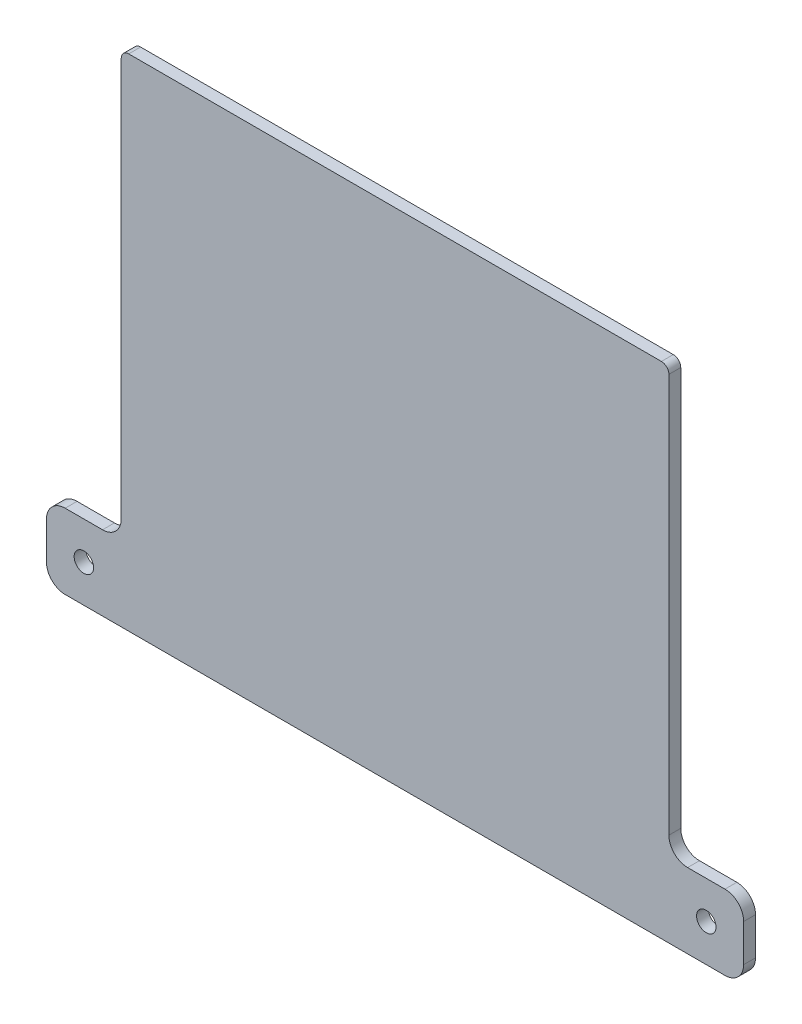
ISO-10303-21;
HEADER;
FILE_DESCRIPTION(('STEP AP214'),'2;1');
FILE_NAME('part.step','',(''),(''),'','','');
FILE_SCHEMA(('AUTOMOTIVE_DESIGN { 1 0 10303 214 1 1 1 1 }'));
ENDSEC;
DATA;
#1=APPLICATION_CONTEXT('core data for automotive mechanical design processes');
#2=APPLICATION_PROTOCOL_DEFINITION('international standard','automotive_design',2000,#1);
#3=PRODUCT_CONTEXT('',#1,'mechanical');
#4=PRODUCT('Part','Part','',(#3));
#5=PRODUCT_RELATED_PRODUCT_CATEGORY('part','',(#4));
#6=PRODUCT_DEFINITION_FORMATION('','',#4);
#7=PRODUCT_DEFINITION_CONTEXT('part definition',#1,'design');
#8=PRODUCT_DEFINITION('design','',#6,#7);
#9=PRODUCT_DEFINITION_SHAPE('','',#8);
#10=(LENGTH_UNIT() NAMED_UNIT(*) SI_UNIT(.MILLI.,.METRE.));
#11=(NAMED_UNIT(*) PLANE_ANGLE_UNIT() SI_UNIT($,.RADIAN.));
#12=(NAMED_UNIT(*) SI_UNIT($,.STERADIAN.) SOLID_ANGLE_UNIT());
#13=UNCERTAINTY_MEASURE_WITH_UNIT(LENGTH_MEASURE(1.E-05),#10,'distance_accuracy_value','');
#14=(GEOMETRIC_REPRESENTATION_CONTEXT(3) GLOBAL_UNCERTAINTY_ASSIGNED_CONTEXT((#13)) GLOBAL_UNIT_ASSIGNED_CONTEXT((#10,
#11,#12)) REPRESENTATION_CONTEXT('',''));
#15=CARTESIAN_POINT('',(0.,0.,0.));
#16=DIRECTION('',(0.,0.,1.));
#17=DIRECTION('',(1.,0.,0.));
#18=AXIS2_PLACEMENT_3D('',#15,#16,#17);
#19=CARTESIAN_POINT('',(0.,-46.875,3.175));
#20=DIRECTION('',(0.,1.,0.));
#21=DIRECTION('',(0.,0.,1.));
#22=AXIS2_PLACEMENT_3D('',#19,#20,#21);
#23=PLANE('',#22);
#24=DIRECTION('',(1.,0.,0.));
#25=VECTOR('',#24,1.);
#26=CARTESIAN_POINT('',(0.,-46.875,0.));
#27=LINE('',#26,#25);
#28=CARTESIAN_POINT('',(-88.25,-46.875,0.));
#29=VERTEX_POINT('',#28);
#30=CARTESIAN_POINT('',(-78.25,-46.875,0.));
#31=VERTEX_POINT('',#30);
#32=EDGE_CURVE('E340',#29,#31,#27,.T.);
#33=ORIENTED_EDGE('',*,*,#32,.F.);
#34=DIRECTION('',(0.,0.,-1.));
#35=VECTOR('',#34,1.);
#36=CARTESIAN_POINT('',(-88.25,-46.875,3.175));
#37=LINE('',#36,#35);
#38=CARTESIAN_POINT('',(-88.25,-46.875,3.175));
#39=VERTEX_POINT('',#38);
#40=EDGE_CURVE('E224',#29,#39,#37,.F.);
#41=ORIENTED_EDGE('',*,*,#40,.T.);
#42=DIRECTION('',(1.,0.,0.));
#43=VECTOR('',#42,1.);
#44=CARTESIAN_POINT('',(0.,-46.875,3.175));
#45=LINE('',#44,#43);
#46=CARTESIAN_POINT('',(-78.25,-46.875,3.175));
#47=VERTEX_POINT('',#46);
#48=EDGE_CURVE('E313',#39,#47,#45,.T.);
#49=ORIENTED_EDGE('',*,*,#48,.T.);
#50=DIRECTION('',(0.,0.,-1.));
#51=VECTOR('',#50,1.);
#52=CARTESIAN_POINT('',(-78.25,-46.875,0.));
#53=LINE('',#52,#51);
#54=EDGE_CURVE('E221',#47,#31,#53,.T.);
#55=ORIENTED_EDGE('',*,*,#54,.T.);
#56=EDGE_LOOP('',(#33,#41,#49,#55));
#57=FACE_BOUND('',#56,.T.);
#58=ADVANCED_FACE('F35',(#57),#23,.T.);
#59=CARTESIAN_POINT('',(-93.25,0.,3.175));
#60=DIRECTION('',(-1.,0.,0.));
#61=DIRECTION('',(0.,0.,1.));
#62=AXIS2_PLACEMENT_3D('',#59,#60,#61);
#63=PLANE('',#62);
#64=DIRECTION('',(0.,1.,0.));
#65=VECTOR('',#64,1.);
#66=CARTESIAN_POINT('',(-93.25,0.,0.));
#67=LINE('',#66,#65);
#68=CARTESIAN_POINT('',(-93.25,-61.875,0.));
#69=VERTEX_POINT('',#68);
#70=CARTESIAN_POINT('',(-93.25,-51.875,0.));
#71=VERTEX_POINT('',#70);
#72=EDGE_CURVE('E342',#69,#71,#67,.T.);
#73=ORIENTED_EDGE('',*,*,#72,.F.);
#74=DIRECTION('',(0.,0.,-1.));
#75=VECTOR('',#74,1.);
#76=CARTESIAN_POINT('',(-93.25,-61.875,3.175));
#77=LINE('',#76,#75);
#78=CARTESIAN_POINT('',(-93.25,-61.875,3.175));
#79=VERTEX_POINT('',#78);
#80=EDGE_CURVE('E219',#69,#79,#77,.F.);
#81=ORIENTED_EDGE('',*,*,#80,.T.);
#82=DIRECTION('',(0.,1.,0.));
#83=VECTOR('',#82,1.);
#84=CARTESIAN_POINT('',(-93.25,0.,3.175));
#85=LINE('',#84,#83);
#86=CARTESIAN_POINT('',(-93.25,-51.875,3.175));
#87=VERTEX_POINT('',#86);
#88=EDGE_CURVE('E317',#79,#87,#85,.T.);
#89=ORIENTED_EDGE('',*,*,#88,.T.);
#90=DIRECTION('',(0.,0.,-1.));
#91=VECTOR('',#90,1.);
#92=CARTESIAN_POINT('',(-93.25,-51.875,3.175));
#93=LINE('',#92,#91);
#94=EDGE_CURVE('E216',#87,#71,#93,.T.);
#95=ORIENTED_EDGE('',*,*,#94,.T.);
#96=EDGE_LOOP('',(#73,#81,#89,#95));
#97=FACE_BOUND('',#96,.T.);
#98=ADVANCED_FACE('F271',(#97),#63,.T.);
#99=CARTESIAN_POINT('',(0.,-66.8749999999999,3.175));
#100=DIRECTION('',(0.,-1.,0.));
#101=DIRECTION('',(1.,0.,0.));
#102=AXIS2_PLACEMENT_3D('',#99,#100,#101);
#103=PLANE('',#102);
#104=DIRECTION('',(-1.,0.,0.));
#105=VECTOR('',#104,1.);
#106=CARTESIAN_POINT('',(0.,-66.8749999999999,0.));
#107=LINE('',#106,#105);
#108=CARTESIAN_POINT('',(88.25,-66.8749999999999,0.));
#109=VERTEX_POINT('',#108);
#110=CARTESIAN_POINT('',(-88.25,-66.875,0.));
#111=VERTEX_POINT('',#110);
#112=EDGE_CURVE('E345',#109,#111,#107,.T.);
#113=ORIENTED_EDGE('',*,*,#112,.F.);
#114=DIRECTION('',(0.,0.,-1.));
#115=VECTOR('',#114,1.);
#116=CARTESIAN_POINT('',(88.25,-66.8749999999999,3.175));
#117=LINE('',#116,#115);
#118=CARTESIAN_POINT('',(88.25,-66.8749999999999,3.175));
#119=VERTEX_POINT('',#118);
#120=EDGE_CURVE('E206',#109,#119,#117,.F.);
#121=ORIENTED_EDGE('',*,*,#120,.T.);
#122=DIRECTION('',(-1.,0.,0.));
#123=VECTOR('',#122,1.);
#124=CARTESIAN_POINT('',(0.,-66.8749999999999,3.175));
#125=LINE('',#124,#123);
#126=CARTESIAN_POINT('',(-88.25,-66.875,3.175));
#127=VERTEX_POINT('',#126);
#128=EDGE_CURVE('E320',#119,#127,#125,.T.);
#129=ORIENTED_EDGE('',*,*,#128,.T.);
#130=DIRECTION('',(0.,0.,-1.));
#131=VECTOR('',#130,1.);
#132=CARTESIAN_POINT('',(-88.25,-66.875,3.175));
#133=LINE('',#132,#131);
#134=EDGE_CURVE('E203',#127,#111,#133,.T.);
#135=ORIENTED_EDGE('',*,*,#134,.T.);
#136=EDGE_LOOP('',(#113,#121,#129,#135));
#137=FACE_BOUND('',#136,.T.);
#138=ADVANCED_FACE('F277',(#137),#103,.T.);
#139=CARTESIAN_POINT('',(93.25,0.,3.175));
#140=DIRECTION('',(-1.,0.,0.));
#141=DIRECTION('',(0.,0.,1.));
#142=AXIS2_PLACEMENT_3D('',#139,#140,#141);
#143=PLANE('',#142);
#144=DIRECTION('',(0.,1.,0.));
#145=VECTOR('',#144,1.);
#146=CARTESIAN_POINT('',(93.25,0.,3.175));
#147=LINE('',#146,#145);
#148=CARTESIAN_POINT('',(93.25,-61.8749999999999,3.175));
#149=VERTEX_POINT('',#148);
#150=CARTESIAN_POINT('',(93.25,-51.875,3.175));
#151=VERTEX_POINT('',#150);
#152=EDGE_CURVE('E327',#149,#151,#147,.T.);
#153=ORIENTED_EDGE('',*,*,#152,.F.);
#154=DIRECTION('',(0.,0.,-1.));
#155=VECTOR('',#154,1.);
#156=CARTESIAN_POINT('',(93.25,-61.8749999999999,0.));
#157=LINE('',#156,#155);
#158=CARTESIAN_POINT('',(93.25,-61.8749999999999,0.));
#159=VERTEX_POINT('',#158);
#160=EDGE_CURVE('E192',#149,#159,#157,.T.);
#161=ORIENTED_EDGE('',*,*,#160,.T.);
#162=DIRECTION('',(0.,1.,0.));
#163=VECTOR('',#162,1.);
#164=CARTESIAN_POINT('',(93.25,0.,0.));
#165=LINE('',#164,#163);
#166=CARTESIAN_POINT('',(93.25,-51.875,0.));
#167=VERTEX_POINT('',#166);
#168=EDGE_CURVE('E178',#159,#167,#165,.T.);
#169=ORIENTED_EDGE('',*,*,#168,.T.);
#170=DIRECTION('',(0.,0.,-1.));
#171=VECTOR('',#170,1.);
#172=CARTESIAN_POINT('',(93.25,-51.875,3.175));
#173=LINE('',#172,#171);
#174=EDGE_CURVE('E190',#167,#151,#173,.F.);
#175=ORIENTED_EDGE('',*,*,#174,.T.);
#176=EDGE_LOOP('',(#153,#161,#169,#175));
#177=FACE_BOUND('',#176,.T.);
#178=ADVANCED_FACE('F352',(#177),#143,.F.);
#179=CARTESIAN_POINT('',(0.,-46.875,3.175));
#180=DIRECTION('',(0.,-1.,0.));
#181=DIRECTION('',(0.,0.,-1.));
#182=AXIS2_PLACEMENT_3D('',#179,#180,#181);
#183=PLANE('',#182);
#184=DIRECTION('',(-1.,0.,0.));
#185=VECTOR('',#184,1.);
#186=CARTESIAN_POINT('',(0.,-46.875,0.));
#187=LINE('',#186,#185);
#188=CARTESIAN_POINT('',(88.25,-46.875,0.));
#189=VERTEX_POINT('',#188);
#190=CARTESIAN_POINT('',(78.25,-46.875,0.));
#191=VERTEX_POINT('',#190);
#192=EDGE_CURVE('E174',#189,#191,#187,.T.);
#193=ORIENTED_EDGE('',*,*,#192,.T.);
#194=DIRECTION('',(0.,0.,-1.));
#195=VECTOR('',#194,1.);
#196=CARTESIAN_POINT('',(78.25,-46.875,3.175));
#197=LINE('',#196,#195);
#198=CARTESIAN_POINT('',(78.25,-46.875,3.175));
#199=VERTEX_POINT('',#198);
#200=EDGE_CURVE('E154',#191,#199,#197,.F.);
#201=ORIENTED_EDGE('',*,*,#200,.T.);
#202=DIRECTION('',(-1.,0.,0.));
#203=VECTOR('',#202,1.);
#204=CARTESIAN_POINT('',(0.,-46.875,3.175));
#205=LINE('',#204,#203);
#206=CARTESIAN_POINT('',(88.25,-46.875,3.175));
#207=VERTEX_POINT('',#206);
#208=EDGE_CURVE('E330',#207,#199,#205,.T.);
#209=ORIENTED_EDGE('',*,*,#208,.F.);
#210=DIRECTION('',(0.,0.,-1.));
#211=VECTOR('',#210,1.);
#212=CARTESIAN_POINT('',(88.25,-46.875,3.175));
#213=LINE('',#212,#211);
#214=EDGE_CURVE('E165',#207,#189,#213,.T.);
#215=ORIENTED_EDGE('',*,*,#214,.T.);
#216=EDGE_LOOP('',(#193,#201,#209,#215));
#217=FACE_BOUND('',#216,.T.);
#218=ADVANCED_FACE('F358',(#217),#183,.F.);
#219=CARTESIAN_POINT('',(73.25,0.,3.175));
#220=DIRECTION('',(-1.,0.,0.));
#221=DIRECTION('',(0.,0.,1.));
#222=AXIS2_PLACEMENT_3D('',#219,#220,#221);
#223=PLANE('',#222);
#224=DIRECTION('',(0.,1.,0.));
#225=VECTOR('',#224,1.);
#226=CARTESIAN_POINT('',(73.25,0.,0.));
#227=LINE('',#226,#225);
#228=CARTESIAN_POINT('',(73.25,-41.875,0.));
#229=VERTEX_POINT('',#228);
#230=CARTESIAN_POINT('',(73.25,64.875,0.));
#231=VERTEX_POINT('',#230);
#232=EDGE_CURVE('E163',#229,#231,#227,.T.);
#233=ORIENTED_EDGE('',*,*,#232,.T.);
#234=DIRECTION('',(0.,0.,-1.));
#235=VECTOR('',#234,1.);
#236=CARTESIAN_POINT('',(73.25,64.875,3.175));
#237=LINE('',#236,#235);
#238=CARTESIAN_POINT('',(73.25,64.875,3.175));
#239=VERTEX_POINT('',#238);
#240=EDGE_CURVE('E11',#231,#239,#237,.F.);
#241=ORIENTED_EDGE('',*,*,#240,.T.);
#242=DIRECTION('',(0.,1.,0.));
#243=VECTOR('',#242,1.);
#244=CARTESIAN_POINT('',(73.25,0.,3.175));
#245=LINE('',#244,#243);
#246=CARTESIAN_POINT('',(73.25,-41.875,3.175));
#247=VERTEX_POINT('',#246);
#248=EDGE_CURVE('E164',#247,#239,#245,.T.);
#249=ORIENTED_EDGE('',*,*,#248,.F.);
#250=DIRECTION('',(0.,0.,-1.));
#251=VECTOR('',#250,1.);
#252=CARTESIAN_POINT('',(73.25,-41.875,0.));
#253=LINE('',#252,#251);
#254=EDGE_CURVE('E153',#247,#229,#253,.T.);
#255=ORIENTED_EDGE('',*,*,#254,.T.);
#256=EDGE_LOOP('',(#233,#241,#249,#255));
#257=FACE_BOUND('',#256,.T.);
#258=ADVANCED_FACE('F162',(#257),#223,.F.);
#259=CARTESIAN_POINT('',(0.,66.875,3.175));
#260=DIRECTION('',(0.,1.,0.));
#261=DIRECTION('',(0.,0.,1.));
#262=AXIS2_PLACEMENT_3D('',#259,#260,#261);
#263=PLANE('',#262);
#264=DIRECTION('',(1.,0.,0.));
#265=VECTOR('',#264,1.);
#266=CARTESIAN_POINT('',(0.,66.875,0.));
#267=LINE('',#266,#265);
#268=CARTESIAN_POINT('',(-71.25,66.875,0.));
#269=VERTEX_POINT('',#268);
#270=CARTESIAN_POINT('',(71.25,66.875,0.));
#271=VERTEX_POINT('',#270);
#272=EDGE_CURVE('E173',#269,#271,#267,.T.);
#273=ORIENTED_EDGE('',*,*,#272,.F.);
#274=DIRECTION('',(0.,0.,-1.));
#275=VECTOR('',#274,1.);
#276=CARTESIAN_POINT('',(-71.25,66.875,3.175));
#277=LINE('',#276,#275);
#278=CARTESIAN_POINT('',(-71.25,66.875,3.175));
#279=VERTEX_POINT('',#278);
#280=EDGE_CURVE('E241',#269,#279,#277,.F.);
#281=ORIENTED_EDGE('',*,*,#280,.T.);
#282=DIRECTION('',(1.,0.,0.));
#283=VECTOR('',#282,1.);
#284=CARTESIAN_POINT('',(0.,66.875,3.175));
#285=LINE('',#284,#283);
#286=CARTESIAN_POINT('',(71.25,66.875,3.175));
#287=VERTEX_POINT('',#286);
#288=EDGE_CURVE('E250',#279,#287,#285,.T.);
#289=ORIENTED_EDGE('',*,*,#288,.T.);
#290=DIRECTION('',(0.,0.,-1.));
#291=VECTOR('',#290,1.);
#292=CARTESIAN_POINT('',(71.25,66.875,0.));
#293=LINE('',#292,#291);
#294=EDGE_CURVE('E238',#287,#271,#293,.T.);
#295=ORIENTED_EDGE('',*,*,#294,.T.);
#296=EDGE_LOOP('',(#273,#281,#289,#295));
#297=FACE_BOUND('',#296,.T.);
#298=ADVANCED_FACE('F262',(#297),#263,.T.);
#299=CARTESIAN_POINT('',(-73.25,0.,3.175));
#300=DIRECTION('',(-1.,0.,0.));
#301=DIRECTION('',(0.,0.,1.));
#302=AXIS2_PLACEMENT_3D('',#299,#300,#301);
#303=PLANE('',#302);
#304=DIRECTION('',(0.,1.,0.));
#305=VECTOR('',#304,1.);
#306=CARTESIAN_POINT('',(-73.25,0.,3.175));
#307=LINE('',#306,#305);
#308=CARTESIAN_POINT('',(-73.25,-41.875,3.175));
#309=VERTEX_POINT('',#308);
#310=CARTESIAN_POINT('',(-73.25,64.875,3.175));
#311=VERTEX_POINT('',#310);
#312=EDGE_CURVE('E248',#309,#311,#307,.T.);
#313=ORIENTED_EDGE('',*,*,#312,.T.);
#314=DIRECTION('',(0.,0.,-1.));
#315=VECTOR('',#314,1.);
#316=CARTESIAN_POINT('',(-73.25,64.875,3.175));
#317=LINE('',#316,#315);
#318=CARTESIAN_POINT('',(-73.25,64.875,0.));
#319=VERTEX_POINT('',#318);
#320=EDGE_CURVE('E232',#311,#319,#317,.T.);
#321=ORIENTED_EDGE('',*,*,#320,.T.);
#322=DIRECTION('',(0.,1.,0.));
#323=VECTOR('',#322,1.);
#324=CARTESIAN_POINT('',(-73.25,0.,0.));
#325=LINE('',#324,#323);
#326=CARTESIAN_POINT('',(-73.25,-41.875,0.));
#327=VERTEX_POINT('',#326);
#328=EDGE_CURVE('E176',#327,#319,#325,.T.);
#329=ORIENTED_EDGE('',*,*,#328,.F.);
#330=DIRECTION('',(0.,0.,-1.));
#331=VECTOR('',#330,1.);
#332=CARTESIAN_POINT('',(-73.25,-41.875,3.175));
#333=LINE('',#332,#331);
#334=EDGE_CURVE('E160',#327,#309,#333,.F.);
#335=ORIENTED_EDGE('',*,*,#334,.T.);
#336=EDGE_LOOP('',(#313,#321,#329,#335));
#337=FACE_BOUND('',#336,.T.);
#338=ADVANCED_FACE('F255',(#337),#303,.T.);
#339=CARTESIAN_POINT('',(-83.25,-56.875,3.175));
#340=DIRECTION('',(0.,0.,-1.));
#341=DIRECTION('',(-1.,0.,0.));
#342=AXIS2_PLACEMENT_3D('',#339,#340,#341);
#343=CYLINDRICAL_SURFACE('',#342,2.6);
#344=CARTESIAN_POINT('',(-83.25,-56.875,3.175));
#345=DIRECTION('',(0.,0.,1.));
#346=DIRECTION('',(1.,0.,0.));
#347=AXIS2_PLACEMENT_3D('',#344,#345,#346);
#348=CIRCLE('',#347,2.6);
#349=CARTESIAN_POINT('',(-80.65,-56.875,3.175));
#350=VERTEX_POINT('',#349);
#351=EDGE_CURVE('E185',#350,#350,#348,.T.);
#352=ORIENTED_EDGE('',*,*,#351,.T.);
#353=EDGE_LOOP('',(#352));
#354=FACE_BOUND('',#353,.T.);
#355=CARTESIAN_POINT('',(-83.25,-56.875,0.));
#356=DIRECTION('',(0.,0.,1.));
#357=DIRECTION('',(1.,0.,0.));
#358=AXIS2_PLACEMENT_3D('',#355,#356,#357);
#359=CIRCLE('',#358,2.6);
#360=CARTESIAN_POINT('',(-80.65,-56.875,0.));
#361=VERTEX_POINT('',#360);
#362=EDGE_CURVE('E337',#361,#361,#359,.T.);
#363=ORIENTED_EDGE('',*,*,#362,.F.);
#364=EDGE_LOOP('',(#363));
#365=FACE_BOUND('',#364,.T.);
#366=ADVANCED_FACE('F283',(#354,#365),#343,.F.);
#367=CARTESIAN_POINT('',(83.25,-56.875,3.175));
#368=DIRECTION('',(0.,0.,-1.));
#369=DIRECTION('',(-1.,0.,0.));
#370=AXIS2_PLACEMENT_3D('',#367,#368,#369);
#371=CYLINDRICAL_SURFACE('',#370,2.6);
#372=CARTESIAN_POINT('',(83.25,-56.875,3.175));
#373=DIRECTION('',(0.,0.,1.));
#374=DIRECTION('',(1.,0.,0.));
#375=AXIS2_PLACEMENT_3D('',#372,#373,#374);
#376=CIRCLE('',#375,2.6);
#377=CARTESIAN_POINT('',(85.85,-56.875,3.175));
#378=VERTEX_POINT('',#377);
#379=EDGE_CURVE('E166',#378,#378,#376,.F.);
#380=ORIENTED_EDGE('',*,*,#379,.F.);
#381=EDGE_LOOP('',(#380));
#382=FACE_BOUND('',#381,.T.);
#383=CARTESIAN_POINT('',(83.25,-56.875,0.));
#384=DIRECTION('',(0.,0.,1.));
#385=DIRECTION('',(1.,0.,0.));
#386=AXIS2_PLACEMENT_3D('',#383,#384,#385);
#387=CIRCLE('',#386,2.6);
#388=CARTESIAN_POINT('',(85.85,-56.875,0.));
#389=VERTEX_POINT('',#388);
#390=EDGE_CURVE('E183',#389,#389,#387,.F.);
#391=ORIENTED_EDGE('',*,*,#390,.T.);
#392=EDGE_LOOP('',(#391));
#393=FACE_BOUND('',#392,.T.);
#394=ADVANCED_FACE('F286',(#382,#393),#371,.F.);
#395=CARTESIAN_POINT('',(0.,0.,3.175));
#396=DIRECTION('',(0.,0.,1.));
#397=DIRECTION('',(1.,0.,0.));
#398=AXIS2_PLACEMENT_3D('',#395,#396,#397);
#399=PLANE('',#398);
#400=ORIENTED_EDGE('',*,*,#351,.F.);
#401=EDGE_LOOP('',(#400));
#402=FACE_BOUND('',#401,.T.);
#403=ORIENTED_EDGE('',*,*,#288,.F.);
#404=CARTESIAN_POINT('',(-71.25,64.875,3.175));
#405=DIRECTION('',(0.,0.,1.));
#406=DIRECTION('',(1.,0.,0.));
#407=AXIS2_PLACEMENT_3D('',#404,#405,#406);
#408=CIRCLE('',#407,2.);
#409=EDGE_CURVE('E43',#279,#311,#408,.T.);
#410=ORIENTED_EDGE('',*,*,#409,.T.);
#411=ORIENTED_EDGE('',*,*,#312,.F.);
#412=CARTESIAN_POINT('',(-78.25,-41.875,3.175));
#413=DIRECTION('',(0.,0.,1.));
#414=DIRECTION('',(1.,0.,0.));
#415=AXIS2_PLACEMENT_3D('',#412,#413,#414);
#416=CIRCLE('',#415,5.);
#417=EDGE_CURVE('E230',#309,#47,#416,.F.);
#418=ORIENTED_EDGE('',*,*,#417,.T.);
#419=ORIENTED_EDGE('',*,*,#48,.F.);
#420=CARTESIAN_POINT('',(-88.25,-51.875,3.175));
#421=DIRECTION('',(0.,0.,1.));
#422=DIRECTION('',(1.,0.,0.));
#423=AXIS2_PLACEMENT_3D('',#420,#421,#422);
#424=CIRCLE('',#423,5.);
#425=EDGE_CURVE('E208',#39,#87,#424,.T.);
#426=ORIENTED_EDGE('',*,*,#425,.T.);
#427=ORIENTED_EDGE('',*,*,#88,.F.);
#428=CARTESIAN_POINT('',(-88.25,-61.875,3.175));
#429=DIRECTION('',(0.,0.,1.));
#430=DIRECTION('',(1.,0.,0.));
#431=AXIS2_PLACEMENT_3D('',#428,#429,#430);
#432=CIRCLE('',#431,5.);
#433=EDGE_CURVE('E210',#79,#127,#432,.T.);
#434=ORIENTED_EDGE('',*,*,#433,.T.);
#435=ORIENTED_EDGE('',*,*,#128,.F.);
#436=CARTESIAN_POINT('',(88.25,-61.8749999999999,3.175));
#437=DIRECTION('',(0.,0.,1.));
#438=DIRECTION('',(1.,0.,0.));
#439=AXIS2_PLACEMENT_3D('',#436,#437,#438);
#440=CIRCLE('',#439,5.);
#441=EDGE_CURVE('E214',#119,#149,#440,.T.);
#442=ORIENTED_EDGE('',*,*,#441,.T.);
#443=ORIENTED_EDGE('',*,*,#152,.T.);
#444=CARTESIAN_POINT('',(88.25,-51.875,3.175));
#445=DIRECTION('',(0.,0.,1.));
#446=DIRECTION('',(1.,0.,0.));
#447=AXIS2_PLACEMENT_3D('',#444,#445,#446);
#448=CIRCLE('',#447,5.);
#449=EDGE_CURVE('E212',#151,#207,#448,.T.);
#450=ORIENTED_EDGE('',*,*,#449,.T.);
#451=ORIENTED_EDGE('',*,*,#208,.T.);
#452=CARTESIAN_POINT('',(78.25,-41.875,3.175));
#453=DIRECTION('',(0.,0.,1.));
#454=DIRECTION('',(1.,0.,0.));
#455=AXIS2_PLACEMENT_3D('',#452,#453,#454);
#456=CIRCLE('',#455,5.);
#457=EDGE_CURVE('E159',#199,#247,#456,.F.);
#458=ORIENTED_EDGE('',*,*,#457,.T.);
#459=ORIENTED_EDGE('',*,*,#248,.T.);
#460=CARTESIAN_POINT('',(71.25,64.875,3.175));
#461=DIRECTION('',(0.,0.,1.));
#462=DIRECTION('',(1.,0.,0.));
#463=AXIS2_PLACEMENT_3D('',#460,#461,#462);
#464=CIRCLE('',#463,2.);
#465=EDGE_CURVE('E55',#239,#287,#464,.T.);
#466=ORIENTED_EDGE('',*,*,#465,.T.);
#467=EDGE_LOOP('',(#403,#410,#411,#418,#419,#426,#427,#434,#435,#442,#443,#450,#451,#458,#459,#466));
#468=FACE_BOUND('',#467,.T.);
#469=ORIENTED_EDGE('',*,*,#379,.T.);
#470=EDGE_LOOP('',(#469));
#471=FACE_BOUND('',#470,.T.);
#472=ADVANCED_FACE('F246',(#402,#468,#471),#399,.T.);
#473=CARTESIAN_POINT('',(0.,0.,0.));
#474=DIRECTION('',(0.,0.,1.));
#475=DIRECTION('',(1.,0.,0.));
#476=AXIS2_PLACEMENT_3D('',#473,#474,#475);
#477=PLANE('',#476);
#478=ORIENTED_EDGE('',*,*,#362,.T.);
#479=EDGE_LOOP('',(#478));
#480=FACE_BOUND('',#479,.T.);
#481=ORIENTED_EDGE('',*,*,#328,.T.);
#482=CARTESIAN_POINT('',(-71.25,64.875,0.));
#483=DIRECTION('',(0.,0.,1.));
#484=DIRECTION('',(1.,0.,0.));
#485=AXIS2_PLACEMENT_3D('',#482,#483,#484);
#486=CIRCLE('',#485,2.);
#487=EDGE_CURVE('E236',#319,#269,#486,.F.);
#488=ORIENTED_EDGE('',*,*,#487,.T.);
#489=ORIENTED_EDGE('',*,*,#272,.T.);
#490=CARTESIAN_POINT('',(71.25,64.875,0.));
#491=DIRECTION('',(0.,0.,1.));
#492=DIRECTION('',(1.,0.,0.));
#493=AXIS2_PLACEMENT_3D('',#490,#491,#492);
#494=CIRCLE('',#493,2.);
#495=EDGE_CURVE('E172',#271,#231,#494,.F.);
#496=ORIENTED_EDGE('',*,*,#495,.T.);
#497=ORIENTED_EDGE('',*,*,#232,.F.);
#498=CARTESIAN_POINT('',(78.25,-41.875,0.));
#499=DIRECTION('',(0.,0.,1.));
#500=DIRECTION('',(1.,0.,0.));
#501=AXIS2_PLACEMENT_3D('',#498,#499,#500);
#502=CIRCLE('',#501,5.);
#503=EDGE_CURVE('E149',#229,#191,#502,.T.);
#504=ORIENTED_EDGE('',*,*,#503,.T.);
#505=ORIENTED_EDGE('',*,*,#192,.F.);
#506=CARTESIAN_POINT('',(88.25,-51.875,0.));
#507=DIRECTION('',(0.,0.,1.));
#508=DIRECTION('',(1.,0.,0.));
#509=AXIS2_PLACEMENT_3D('',#506,#507,#508);
#510=CIRCLE('',#509,5.);
#511=EDGE_CURVE('E199',#189,#167,#510,.F.);
#512=ORIENTED_EDGE('',*,*,#511,.T.);
#513=ORIENTED_EDGE('',*,*,#168,.F.);
#514=CARTESIAN_POINT('',(88.25,-61.8749999999999,0.));
#515=DIRECTION('',(0.,0.,1.));
#516=DIRECTION('',(1.,0.,0.));
#517=AXIS2_PLACEMENT_3D('',#514,#515,#516);
#518=CIRCLE('',#517,5.);
#519=EDGE_CURVE('E201',#159,#109,#518,.F.);
#520=ORIENTED_EDGE('',*,*,#519,.T.);
#521=ORIENTED_EDGE('',*,*,#112,.T.);
#522=CARTESIAN_POINT('',(-88.25,-61.875,0.));
#523=DIRECTION('',(0.,0.,1.));
#524=DIRECTION('',(1.,0.,0.));
#525=AXIS2_PLACEMENT_3D('',#522,#523,#524);
#526=CIRCLE('',#525,5.);
#527=EDGE_CURVE('E197',#111,#69,#526,.F.);
#528=ORIENTED_EDGE('',*,*,#527,.T.);
#529=ORIENTED_EDGE('',*,*,#72,.T.);
#530=CARTESIAN_POINT('',(-88.25,-51.875,0.));
#531=DIRECTION('',(0.,0.,1.));
#532=DIRECTION('',(1.,0.,0.));
#533=AXIS2_PLACEMENT_3D('',#530,#531,#532);
#534=CIRCLE('',#533,5.);
#535=EDGE_CURVE('E195',#71,#29,#534,.F.);
#536=ORIENTED_EDGE('',*,*,#535,.T.);
#537=ORIENTED_EDGE('',*,*,#32,.T.);
#538=CARTESIAN_POINT('',(-78.25,-41.875,0.));
#539=DIRECTION('',(0.,0.,1.));
#540=DIRECTION('',(1.,0.,0.));
#541=AXIS2_PLACEMENT_3D('',#538,#539,#540);
#542=CIRCLE('',#541,5.);
#543=EDGE_CURVE('E228',#31,#327,#542,.T.);
#544=ORIENTED_EDGE('',*,*,#543,.T.);
#545=EDGE_LOOP('',(#481,#488,#489,#496,#497,#504,#505,#512,#513,#520,#521,#528,#529,#536,#537,#544));
#546=FACE_BOUND('',#545,.T.);
#547=ORIENTED_EDGE('',*,*,#390,.F.);
#548=EDGE_LOOP('',(#547));
#549=FACE_BOUND('',#548,.T.);
#550=ADVANCED_FACE('F169',(#480,#546,#549),#477,.F.);
#551=CARTESIAN_POINT('',(78.25,-41.875,3.175));
#552=DIRECTION('',(0.,0.,1.));
#553=DIRECTION('',(1.,0.,0.));
#554=AXIS2_PLACEMENT_3D('',#551,#552,#553);
#555=CYLINDRICAL_SURFACE('',#554,5.);
#556=ORIENTED_EDGE('',*,*,#457,.F.);
#557=ORIENTED_EDGE('',*,*,#200,.F.);
#558=ORIENTED_EDGE('',*,*,#503,.F.);
#559=ORIENTED_EDGE('',*,*,#254,.F.);
#560=EDGE_LOOP('',(#556,#557,#558,#559));
#561=FACE_BOUND('',#560,.T.);
#562=ADVANCED_FACE('F152',(#561),#555,.F.);
#563=CARTESIAN_POINT('',(88.25,-61.8749999999999,3.175));
#564=DIRECTION('',(0.,0.,1.));
#565=DIRECTION('',(1.,0.,0.));
#566=AXIS2_PLACEMENT_3D('',#563,#564,#565);
#567=CYLINDRICAL_SURFACE('',#566,5.);
#568=ORIENTED_EDGE('',*,*,#441,.F.);
#569=ORIENTED_EDGE('',*,*,#120,.F.);
#570=ORIENTED_EDGE('',*,*,#519,.F.);
#571=ORIENTED_EDGE('',*,*,#160,.F.);
#572=EDGE_LOOP('',(#568,#569,#570,#571));
#573=FACE_BOUND('',#572,.T.);
#574=ADVANCED_FACE('F290',(#573),#567,.T.);
#575=CARTESIAN_POINT('',(88.25,-51.875,3.175));
#576=DIRECTION('',(0.,0.,-1.));
#577=DIRECTION('',(-1.,0.,0.));
#578=AXIS2_PLACEMENT_3D('',#575,#576,#577);
#579=CYLINDRICAL_SURFACE('',#578,5.);
#580=ORIENTED_EDGE('',*,*,#449,.F.);
#581=ORIENTED_EDGE('',*,*,#174,.F.);
#582=ORIENTED_EDGE('',*,*,#511,.F.);
#583=ORIENTED_EDGE('',*,*,#214,.F.);
#584=EDGE_LOOP('',(#580,#581,#582,#583));
#585=FACE_BOUND('',#584,.T.);
#586=ADVANCED_FACE('F293',(#585),#579,.T.);
#587=CARTESIAN_POINT('',(-88.25,-61.875,3.175));
#588=DIRECTION('',(0.,0.,-1.));
#589=DIRECTION('',(-1.,0.,0.));
#590=AXIS2_PLACEMENT_3D('',#587,#588,#589);
#591=CYLINDRICAL_SURFACE('',#590,5.);
#592=ORIENTED_EDGE('',*,*,#433,.F.);
#593=ORIENTED_EDGE('',*,*,#80,.F.);
#594=ORIENTED_EDGE('',*,*,#527,.F.);
#595=ORIENTED_EDGE('',*,*,#134,.F.);
#596=EDGE_LOOP('',(#592,#593,#594,#595));
#597=FACE_BOUND('',#596,.T.);
#598=ADVANCED_FACE('F297',(#597),#591,.T.);
#599=CARTESIAN_POINT('',(-88.25,-51.875,3.175));
#600=DIRECTION('',(0.,0.,-1.));
#601=DIRECTION('',(-1.,0.,0.));
#602=AXIS2_PLACEMENT_3D('',#599,#600,#601);
#603=CYLINDRICAL_SURFACE('',#602,5.);
#604=ORIENTED_EDGE('',*,*,#425,.F.);
#605=ORIENTED_EDGE('',*,*,#40,.F.);
#606=ORIENTED_EDGE('',*,*,#535,.F.);
#607=ORIENTED_EDGE('',*,*,#94,.F.);
#608=EDGE_LOOP('',(#604,#605,#606,#607));
#609=FACE_BOUND('',#608,.T.);
#610=ADVANCED_FACE('F301',(#609),#603,.T.);
#611=CARTESIAN_POINT('',(-78.25,-41.875,3.175));
#612=DIRECTION('',(0.,0.,1.));
#613=DIRECTION('',(1.,0.,0.));
#614=AXIS2_PLACEMENT_3D('',#611,#612,#613);
#615=CYLINDRICAL_SURFACE('',#614,5.);
#616=ORIENTED_EDGE('',*,*,#417,.F.);
#617=ORIENTED_EDGE('',*,*,#334,.F.);
#618=ORIENTED_EDGE('',*,*,#543,.F.);
#619=ORIENTED_EDGE('',*,*,#54,.F.);
#620=EDGE_LOOP('',(#616,#617,#618,#619));
#621=FACE_BOUND('',#620,.T.);
#622=ADVANCED_FACE('F269',(#621),#615,.F.);
#623=CARTESIAN_POINT('',(-71.25,64.875,3.175));
#624=DIRECTION('',(0.,0.,-1.));
#625=DIRECTION('',(-1.,0.,0.));
#626=AXIS2_PLACEMENT_3D('',#623,#624,#625);
#627=CYLINDRICAL_SURFACE('',#626,2.);
#628=ORIENTED_EDGE('',*,*,#409,.F.);
#629=ORIENTED_EDGE('',*,*,#280,.F.);
#630=ORIENTED_EDGE('',*,*,#487,.F.);
#631=ORIENTED_EDGE('',*,*,#320,.F.);
#632=EDGE_LOOP('',(#628,#629,#630,#631));
#633=FACE_BOUND('',#632,.T.);
#634=ADVANCED_FACE('F259',(#633),#627,.T.);
#635=CARTESIAN_POINT('',(71.25,64.875,3.175));
#636=DIRECTION('',(0.,0.,1.));
#637=DIRECTION('',(1.,0.,0.));
#638=AXIS2_PLACEMENT_3D('',#635,#636,#637);
#639=CYLINDRICAL_SURFACE('',#638,2.);
#640=ORIENTED_EDGE('',*,*,#465,.F.);
#641=ORIENTED_EDGE('',*,*,#240,.F.);
#642=ORIENTED_EDGE('',*,*,#495,.F.);
#643=ORIENTED_EDGE('',*,*,#294,.F.);
#644=EDGE_LOOP('',(#640,#641,#642,#643));
#645=FACE_BOUND('',#644,.T.);
#646=ADVANCED_FACE('F37',(#645),#639,.T.);
#647=CLOSED_SHELL('',(#58,#98,#138,#178,#218,#258,#298,#338,#366,#394,#472,#550,#562,#574,#586,
#598,#610,#622,#634,#646));
#648=MANIFOLD_SOLID_BREP('B2',#647);
#649=ADVANCED_BREP_SHAPE_REPRESENTATION('',(#18,#648),#14);
#650=SHAPE_DEFINITION_REPRESENTATION(#9,#649);
ENDSEC;
END-ISO-10303-21;
